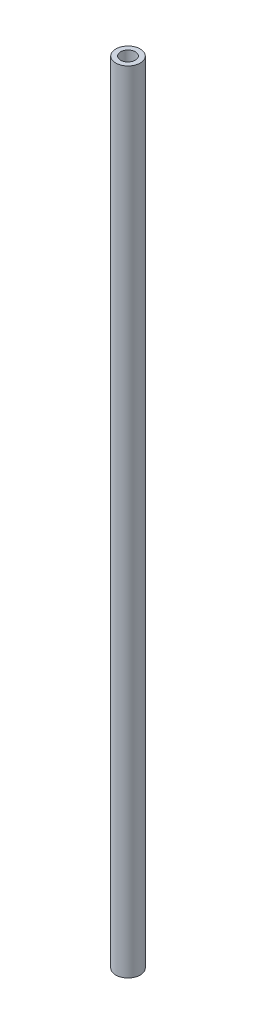
ISO-10303-21;
HEADER;
FILE_DESCRIPTION(('STEP AP214'),'2;1');
FILE_NAME('part.step','',(''),(''),'','','');
FILE_SCHEMA(('AUTOMOTIVE_DESIGN { 1 0 10303 214 1 1 1 1 }'));
ENDSEC;
DATA;
#1=APPLICATION_CONTEXT('core data for automotive mechanical design processes');
#2=APPLICATION_PROTOCOL_DEFINITION('international standard','automotive_design',2000,#1);
#3=PRODUCT_CONTEXT('',#1,'mechanical');
#4=PRODUCT('Part','Part','',(#3));
#5=PRODUCT_RELATED_PRODUCT_CATEGORY('part','',(#4));
#6=PRODUCT_DEFINITION_FORMATION('','',#4);
#7=PRODUCT_DEFINITION_CONTEXT('part definition',#1,'design');
#8=PRODUCT_DEFINITION('design','',#6,#7);
#9=PRODUCT_DEFINITION_SHAPE('','',#8);
#10=(LENGTH_UNIT() NAMED_UNIT(*) SI_UNIT(.MILLI.,.METRE.));
#11=(NAMED_UNIT(*) PLANE_ANGLE_UNIT() SI_UNIT($,.RADIAN.));
#12=(NAMED_UNIT(*) SI_UNIT($,.STERADIAN.) SOLID_ANGLE_UNIT());
#13=UNCERTAINTY_MEASURE_WITH_UNIT(LENGTH_MEASURE(1.E-05),#10,'distance_accuracy_value','');
#14=(GEOMETRIC_REPRESENTATION_CONTEXT(3) GLOBAL_UNCERTAINTY_ASSIGNED_CONTEXT((#13)) GLOBAL_UNIT_ASSIGNED_CONTEXT((#10,
#11,#12)) REPRESENTATION_CONTEXT('',''));
#15=CARTESIAN_POINT('',(0.,0.,0.));
#16=DIRECTION('',(0.,0.,1.));
#17=DIRECTION('',(1.,0.,0.));
#18=AXIS2_PLACEMENT_3D('',#15,#16,#17);
#19=CARTESIAN_POINT('',(0.,323.,0.));
#20=DIRECTION('',(0.,1.,0.));
#21=DIRECTION('',(0.,0.,1.));
#22=AXIS2_PLACEMENT_3D('',#19,#20,#21);
#23=PLANE('',#22);
#24=CARTESIAN_POINT('',(0.,323.,0.));
#25=DIRECTION('',(0.,1.,0.));
#26=DIRECTION('',(0.,0.,1.));
#27=AXIS2_PLACEMENT_3D('',#24,#25,#26);
#28=CIRCLE('',#27,5.);
#29=CARTESIAN_POINT('',(0.,323.,5.));
#30=VERTEX_POINT('',#29);
#31=EDGE_CURVE('E10',#30,#30,#28,.T.);
#32=ORIENTED_EDGE('',*,*,#31,.T.);
#33=EDGE_LOOP('',(#32));
#34=FACE_BOUND('',#33,.T.);
#35=CARTESIAN_POINT('',(0.,323.,0.));
#36=DIRECTION('',(0.,1.,0.));
#37=DIRECTION('',(0.,0.,1.));
#38=AXIS2_PLACEMENT_3D('',#35,#36,#37);
#39=CIRCLE('',#38,3.);
#40=CARTESIAN_POINT('',(0.,323.,3.));
#41=VERTEX_POINT('',#40);
#42=EDGE_CURVE('E44',#41,#41,#39,.T.);
#43=ORIENTED_EDGE('',*,*,#42,.F.);
#44=EDGE_LOOP('',(#43));
#45=FACE_BOUND('',#44,.T.);
#46=ADVANCED_FACE('F33',(#34,#45),#23,.T.);
#47=CARTESIAN_POINT('',(0.,0.,0.));
#48=DIRECTION('',(0.,1.,0.));
#49=DIRECTION('',(0.,0.,1.));
#50=AXIS2_PLACEMENT_3D('',#47,#48,#49);
#51=PLANE('',#50);
#52=CARTESIAN_POINT('',(0.,0.,0.));
#53=DIRECTION('',(0.,1.,0.));
#54=DIRECTION('',(0.,0.,1.));
#55=AXIS2_PLACEMENT_3D('',#52,#53,#54);
#56=CIRCLE('',#55,5.);
#57=CARTESIAN_POINT('',(0.,0.,5.));
#58=VERTEX_POINT('',#57);
#59=EDGE_CURVE('E37',#58,#58,#56,.T.);
#60=ORIENTED_EDGE('',*,*,#59,.F.);
#61=EDGE_LOOP('',(#60));
#62=FACE_BOUND('',#61,.T.);
#63=CARTESIAN_POINT('',(0.,0.,0.));
#64=DIRECTION('',(0.,1.,0.));
#65=DIRECTION('',(0.,0.,1.));
#66=AXIS2_PLACEMENT_3D('',#63,#64,#65);
#67=CIRCLE('',#66,3.);
#68=CARTESIAN_POINT('',(0.,0.,3.));
#69=VERTEX_POINT('',#68);
#70=EDGE_CURVE('E46',#69,#69,#67,.T.);
#71=ORIENTED_EDGE('',*,*,#70,.T.);
#72=EDGE_LOOP('',(#71));
#73=FACE_BOUND('',#72,.T.);
#74=ADVANCED_FACE('F56',(#62,#73),#51,.F.);
#75=CARTESIAN_POINT('',(0.,323.,0.));
#76=DIRECTION('',(0.,-1.,0.));
#77=DIRECTION('',(0.,0.,-1.));
#78=AXIS2_PLACEMENT_3D('',#75,#76,#77);
#79=CYLINDRICAL_SURFACE('',#78,5.);
#80=ORIENTED_EDGE('',*,*,#31,.F.);
#81=EDGE_LOOP('',(#80));
#82=FACE_BOUND('',#81,.T.);
#83=ORIENTED_EDGE('',*,*,#59,.T.);
#84=EDGE_LOOP('',(#83));
#85=FACE_BOUND('',#84,.T.);
#86=ADVANCED_FACE('F35',(#82,#85),#79,.T.);
#87=CARTESIAN_POINT('',(0.,323.,0.));
#88=DIRECTION('',(0.,-1.,0.));
#89=DIRECTION('',(0.,0.,-1.));
#90=AXIS2_PLACEMENT_3D('',#87,#88,#89);
#91=CYLINDRICAL_SURFACE('',#90,3.);
#92=ORIENTED_EDGE('',*,*,#42,.T.);
#93=EDGE_LOOP('',(#92));
#94=FACE_BOUND('',#93,.T.);
#95=ORIENTED_EDGE('',*,*,#70,.F.);
#96=EDGE_LOOP('',(#95));
#97=FACE_BOUND('',#96,.T.);
#98=ADVANCED_FACE('F52',(#94,#97),#91,.F.);
#99=CLOSED_SHELL('',(#46,#74,#86,#98));
#100=MANIFOLD_SOLID_BREP('B2',#99);
#101=ADVANCED_BREP_SHAPE_REPRESENTATION('',(#18,#100),#14);
#102=SHAPE_DEFINITION_REPRESENTATION(#9,#101);
ENDSEC;
END-ISO-10303-21;
